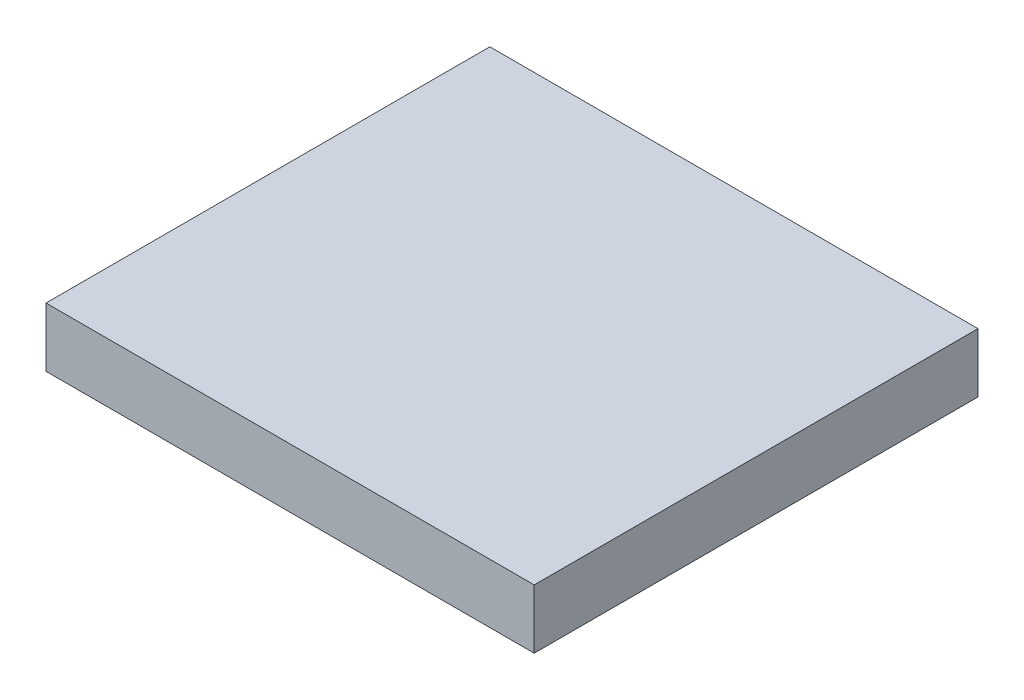
ISO-10303-21;
HEADER;
FILE_DESCRIPTION(('STEP AP214'),'2;1');
FILE_NAME('part.step','',(''),(''),'','','');
FILE_SCHEMA(('AUTOMOTIVE_DESIGN { 1 0 10303 214 1 1 1 1 }'));
ENDSEC;
DATA;
#1=APPLICATION_CONTEXT('core data for automotive mechanical design processes');
#2=APPLICATION_PROTOCOL_DEFINITION('international standard','automotive_design',2000,#1);
#3=PRODUCT_CONTEXT('',#1,'mechanical');
#4=PRODUCT('Part','Part','',(#3));
#5=PRODUCT_RELATED_PRODUCT_CATEGORY('part','',(#4));
#6=PRODUCT_DEFINITION_FORMATION('','',#4);
#7=PRODUCT_DEFINITION_CONTEXT('part definition',#1,'design');
#8=PRODUCT_DEFINITION('design','',#6,#7);
#9=PRODUCT_DEFINITION_SHAPE('','',#8);
#10=(LENGTH_UNIT() NAMED_UNIT(*) SI_UNIT(.MILLI.,.METRE.));
#11=(NAMED_UNIT(*) PLANE_ANGLE_UNIT() SI_UNIT($,.RADIAN.));
#12=(NAMED_UNIT(*) SI_UNIT($,.STERADIAN.) SOLID_ANGLE_UNIT());
#13=UNCERTAINTY_MEASURE_WITH_UNIT(LENGTH_MEASURE(1.E-05),#10,'distance_accuracy_value','');
#14=(GEOMETRIC_REPRESENTATION_CONTEXT(3) GLOBAL_UNCERTAINTY_ASSIGNED_CONTEXT((#13)) GLOBAL_UNIT_ASSIGNED_CONTEXT((#10,
#11,#12)) REPRESENTATION_CONTEXT('',''));
#15=CARTESIAN_POINT('',(0.,0.,0.));
#16=DIRECTION('',(0.,0.,1.));
#17=DIRECTION('',(1.,0.,0.));
#18=AXIS2_PLACEMENT_3D('',#15,#16,#17);
#19=CARTESIAN_POINT('',(-25.2592702702703,5.08,-10.4775));
#20=DIRECTION('',(1.,0.,0.));
#21=DIRECTION('',(0.,0.,-1.));
#22=AXIS2_PLACEMENT_3D('',#19,#20,#21);
#23=PLANE('',#22);
#24=CARTESIAN_POINT('',(-25.2592702702703,2.42272295699006,-0.317500000000001));
#25=DIRECTION('',(-1.,0.,0.));
#26=DIRECTION('',(0.,0.,1.));
#27=AXIS2_PLACEMENT_3D('',#24,#25,#26);
#28=CIRCLE('',#27,1.18745);
#29=CARTESIAN_POINT('',(-25.2592702702703,2.42272295699006,0.869949999999999));
#30=VERTEX_POINT('',#29);
#31=EDGE_CURVE('E102',#30,#30,#28,.T.);
#32=ORIENTED_EDGE('',*,*,#31,.F.);
#33=EDGE_LOOP('',(#32));
#34=FACE_BOUND('',#33,.T.);
#35=CARTESIAN_POINT('',(-25.2592702702703,2.42272295699006,22.5425));
#36=DIRECTION('',(-1.,0.,0.));
#37=DIRECTION('',(0.,0.,1.));
#38=AXIS2_PLACEMENT_3D('',#35,#36,#37);
#39=CIRCLE('',#38,1.18745);
#40=CARTESIAN_POINT('',(-25.2592702702703,2.42272295699006,23.72995));
#41=VERTEX_POINT('',#40);
#42=EDGE_CURVE('E101',#41,#41,#39,.T.);
#43=ORIENTED_EDGE('',*,*,#42,.F.);
#44=EDGE_LOOP('',(#43));
#45=FACE_BOUND('',#44,.T.);
#46=DIRECTION('',(0.,0.,1.));
#47=VECTOR('',#46,1.);
#48=CARTESIAN_POINT('',(-25.2592702702703,0.,-10.4775));
#49=LINE('',#48,#47);
#50=CARTESIAN_POINT('',(-25.2592702702703,0.,-10.4775));
#51=VERTEX_POINT('',#50);
#52=CARTESIAN_POINT('',(-25.2592702702703,0.,27.6225));
#53=VERTEX_POINT('',#52);
#54=EDGE_CURVE('E112',#51,#53,#49,.T.);
#55=ORIENTED_EDGE('',*,*,#54,.T.);
#56=DIRECTION('',(0.,-1.,0.));
#57=VECTOR('',#56,1.);
#58=CARTESIAN_POINT('',(-25.2592702702703,5.08,27.6225));
#59=LINE('',#58,#57);
#60=CARTESIAN_POINT('',(-25.2592702702703,5.08,27.6225));
#61=VERTEX_POINT('',#60);
#62=EDGE_CURVE('E11',#61,#53,#59,.T.);
#63=ORIENTED_EDGE('',*,*,#62,.F.);
#64=DIRECTION('',(0.,0.,1.));
#65=VECTOR('',#64,1.);
#66=CARTESIAN_POINT('',(-25.2592702702703,5.08,-10.4775));
#67=LINE('',#66,#65);
#68=CARTESIAN_POINT('',(-25.2592702702703,5.08,-10.4775));
#69=VERTEX_POINT('',#68);
#70=EDGE_CURVE('E113',#69,#61,#67,.T.);
#71=ORIENTED_EDGE('',*,*,#70,.F.);
#72=DIRECTION('',(0.,-1.,0.));
#73=VECTOR('',#72,1.);
#74=CARTESIAN_POINT('',(-25.2592702702703,5.08,-10.4775));
#75=LINE('',#74,#73);
#76=EDGE_CURVE('E119',#69,#51,#75,.T.);
#77=ORIENTED_EDGE('',*,*,#76,.T.);
#78=EDGE_LOOP('',(#55,#63,#71,#77));
#79=FACE_BOUND('',#78,.T.);
#80=ADVANCED_FACE('F37',(#34,#45,#79),#23,.F.);
#81=CARTESIAN_POINT('',(-25.2592702702703,5.08,27.6225));
#82=DIRECTION('',(0.,0.,-1.));
#83=DIRECTION('',(-1.,0.,0.));
#84=AXIS2_PLACEMENT_3D('',#81,#82,#83);
#85=PLANE('',#84);
#86=DIRECTION('',(1.,0.,0.));
#87=VECTOR('',#86,1.);
#88=CARTESIAN_POINT('',(-25.2592702702703,0.,27.6225));
#89=LINE('',#88,#87);
#90=CARTESIAN_POINT('',(16.6507297297297,0.,27.6225));
#91=VERTEX_POINT('',#90);
#92=EDGE_CURVE('E122',#53,#91,#89,.T.);
#93=ORIENTED_EDGE('',*,*,#92,.T.);
#94=DIRECTION('',(0.,-1.,0.));
#95=VECTOR('',#94,1.);
#96=CARTESIAN_POINT('',(16.6507297297297,5.08,27.6225));
#97=LINE('',#96,#95);
#98=CARTESIAN_POINT('',(16.6507297297297,5.08,27.6225));
#99=VERTEX_POINT('',#98);
#100=EDGE_CURVE('E45',#99,#91,#97,.T.);
#101=ORIENTED_EDGE('',*,*,#100,.F.);
#102=DIRECTION('',(1.,0.,0.));
#103=VECTOR('',#102,1.);
#104=CARTESIAN_POINT('',(-25.2592702702703,5.08,27.6225));
#105=LINE('',#104,#103);
#106=EDGE_CURVE('E84',#61,#99,#105,.T.);
#107=ORIENTED_EDGE('',*,*,#106,.F.);
#108=ORIENTED_EDGE('',*,*,#62,.T.);
#109=EDGE_LOOP('',(#93,#101,#107,#108));
#110=FACE_BOUND('',#109,.T.);
#111=ADVANCED_FACE('F145',(#110),#85,.F.);
#112=CARTESIAN_POINT('',(16.6507297297297,5.08,-10.4775));
#113=DIRECTION('',(-1.,0.,0.));
#114=DIRECTION('',(0.,0.,1.));
#115=AXIS2_PLACEMENT_3D('',#112,#113,#114);
#116=PLANE('',#115);
#117=DIRECTION('',(0.,0.,-1.));
#118=VECTOR('',#117,1.);
#119=CARTESIAN_POINT('',(16.6507297297297,0.,-10.4775));
#120=LINE('',#119,#118);
#121=CARTESIAN_POINT('',(16.6507297297297,0.,-10.4775));
#122=VERTEX_POINT('',#121);
#123=EDGE_CURVE('E71',#91,#122,#120,.T.);
#124=ORIENTED_EDGE('',*,*,#123,.T.);
#125=DIRECTION('',(0.,-1.,0.));
#126=VECTOR('',#125,1.);
#127=CARTESIAN_POINT('',(16.6507297297297,5.08,-10.4775));
#128=LINE('',#127,#126);
#129=CARTESIAN_POINT('',(16.6507297297297,5.08,-10.4775));
#130=VERTEX_POINT('',#129);
#131=EDGE_CURVE('E127',#130,#122,#128,.T.);
#132=ORIENTED_EDGE('',*,*,#131,.F.);
#133=DIRECTION('',(0.,0.,-1.));
#134=VECTOR('',#133,1.);
#135=CARTESIAN_POINT('',(16.6507297297297,5.08,-10.4775));
#136=LINE('',#135,#134);
#137=EDGE_CURVE('E116',#99,#130,#136,.T.);
#138=ORIENTED_EDGE('',*,*,#137,.F.);
#139=ORIENTED_EDGE('',*,*,#100,.T.);
#140=EDGE_LOOP('',(#124,#132,#138,#139));
#141=FACE_BOUND('',#140,.T.);
#142=ADVANCED_FACE('F129',(#141),#116,.F.);
#143=CARTESIAN_POINT('',(-25.2592702702703,5.08,-10.4775));
#144=DIRECTION('',(0.,0.,1.));
#145=DIRECTION('',(1.,0.,0.));
#146=AXIS2_PLACEMENT_3D('',#143,#144,#145);
#147=PLANE('',#146);
#148=DIRECTION('',(-1.,0.,0.));
#149=VECTOR('',#148,1.);
#150=CARTESIAN_POINT('',(-25.2592702702703,0.,-10.4775));
#151=LINE('',#150,#149);
#152=EDGE_CURVE('E77',#122,#51,#151,.T.);
#153=ORIENTED_EDGE('',*,*,#152,.T.);
#154=ORIENTED_EDGE('',*,*,#76,.F.);
#155=DIRECTION('',(-1.,0.,0.));
#156=VECTOR('',#155,1.);
#157=CARTESIAN_POINT('',(-25.2592702702703,5.08,-10.4775));
#158=LINE('',#157,#156);
#159=EDGE_CURVE('E53',#130,#69,#158,.T.);
#160=ORIENTED_EDGE('',*,*,#159,.F.);
#161=ORIENTED_EDGE('',*,*,#131,.T.);
#162=EDGE_LOOP('',(#153,#154,#160,#161));
#163=FACE_BOUND('',#162,.T.);
#164=ADVANCED_FACE('F136',(#163),#147,.F.);
#165=CARTESIAN_POINT('',(0.,5.08,0.));
#166=DIRECTION('',(0.,1.,0.));
#167=DIRECTION('',(0.,0.,1.));
#168=AXIS2_PLACEMENT_3D('',#165,#166,#167);
#169=PLANE('',#168);
#170=ORIENTED_EDGE('',*,*,#70,.T.);
#171=ORIENTED_EDGE('',*,*,#106,.T.);
#172=ORIENTED_EDGE('',*,*,#137,.T.);
#173=ORIENTED_EDGE('',*,*,#159,.T.);
#174=EDGE_LOOP('',(#170,#171,#172,#173));
#175=FACE_BOUND('',#174,.T.);
#176=ADVANCED_FACE('F138',(#175),#169,.T.);
#177=CARTESIAN_POINT('',(0.,0.,0.));
#178=DIRECTION('',(0.,1.,0.));
#179=DIRECTION('',(0.,0.,1.));
#180=AXIS2_PLACEMENT_3D('',#177,#178,#179);
#181=PLANE('',#180);
#182=ORIENTED_EDGE('',*,*,#54,.F.);
#183=ORIENTED_EDGE('',*,*,#152,.F.);
#184=ORIENTED_EDGE('',*,*,#123,.F.);
#185=ORIENTED_EDGE('',*,*,#92,.F.);
#186=EDGE_LOOP('',(#182,#183,#184,#185));
#187=FACE_BOUND('',#186,.T.);
#188=ADVANCED_FACE('F132',(#187),#181,.F.);
#189=CARTESIAN_POINT('',(-15.0992702702703,2.42272295699006,22.5425));
#190=DIRECTION('',(-1.,0.,0.));
#191=DIRECTION('',(0.,0.,1.));
#192=AXIS2_PLACEMENT_3D('',#189,#190,#191);
#193=CONICAL_SURFACE('',#192,1.18745,1.02974425867665);
#194=CARTESIAN_POINT('',(-14.385778328206,2.42272295699006,22.5425));
#195=VERTEX_POINT('',#194);
#196=VERTEX_LOOP('',#195);
#197=FACE_BOUND('',#196,.T.);
#198=CARTESIAN_POINT('',(-15.0992702702703,2.42272295699006,22.5425));
#199=DIRECTION('',(-1.,0.,0.));
#200=DIRECTION('',(0.,0.,1.));
#201=AXIS2_PLACEMENT_3D('',#198,#199,#200);
#202=CIRCLE('',#201,1.18745);
#203=CARTESIAN_POINT('',(-15.0992702702703,2.42272295699006,23.72995));
#204=VERTEX_POINT('',#203);
#205=EDGE_CURVE('E105',#204,#204,#202,.T.);
#206=ORIENTED_EDGE('',*,*,#205,.T.);
#207=EDGE_LOOP('',(#206));
#208=FACE_BOUND('',#207,.T.);
#209=ADVANCED_FACE('F158',(#197,#208),#193,.F.);
#210=CARTESIAN_POINT('',(-25.2592702702703,2.42272295699006,22.5425));
#211=DIRECTION('',(-1.,0.,0.));
#212=DIRECTION('',(0.,0.,1.));
#213=AXIS2_PLACEMENT_3D('',#210,#211,#212);
#214=CYLINDRICAL_SURFACE('',#213,1.18745);
#215=ORIENTED_EDGE('',*,*,#205,.F.);
#216=EDGE_LOOP('',(#215));
#217=FACE_BOUND('',#216,.T.);
#218=ORIENTED_EDGE('',*,*,#42,.T.);
#219=EDGE_LOOP('',(#218));
#220=FACE_BOUND('',#219,.T.);
#221=ADVANCED_FACE('F95',(#217,#220),#214,.F.);
#222=CARTESIAN_POINT('',(-15.0992702702703,2.42272295699006,-0.317500000000003));
#223=DIRECTION('',(-1.,0.,0.));
#224=DIRECTION('',(0.,0.,1.));
#225=AXIS2_PLACEMENT_3D('',#222,#223,#224);
#226=CONICAL_SURFACE('',#225,1.18745,1.02974425867665);
#227=CARTESIAN_POINT('',(-14.385778328206,2.42272295699006,-0.317500000000003));
#228=VERTEX_POINT('',#227);
#229=VERTEX_LOOP('',#228);
#230=FACE_BOUND('',#229,.T.);
#231=CARTESIAN_POINT('',(-15.0992702702703,2.42272295699006,-0.317500000000003));
#232=DIRECTION('',(-1.,0.,0.));
#233=DIRECTION('',(0.,0.,1.));
#234=AXIS2_PLACEMENT_3D('',#231,#232,#233);
#235=CIRCLE('',#234,1.18745);
#236=CARTESIAN_POINT('',(-15.0992702702703,2.42272295699006,0.869949999999995));
#237=VERTEX_POINT('',#236);
#238=EDGE_CURVE('E99',#237,#237,#235,.T.);
#239=ORIENTED_EDGE('',*,*,#238,.T.);
#240=EDGE_LOOP('',(#239));
#241=FACE_BOUND('',#240,.T.);
#242=ADVANCED_FACE('F91',(#230,#241),#226,.F.);
#243=CARTESIAN_POINT('',(-25.2592702702703,2.42272295699006,-0.317500000000001));
#244=DIRECTION('',(-1.,0.,0.));
#245=DIRECTION('',(0.,0.,1.));
#246=AXIS2_PLACEMENT_3D('',#243,#244,#245);
#247=CYLINDRICAL_SURFACE('',#246,1.18745);
#248=ORIENTED_EDGE('',*,*,#238,.F.);
#249=EDGE_LOOP('',(#248));
#250=FACE_BOUND('',#249,.T.);
#251=ORIENTED_EDGE('',*,*,#31,.T.);
#252=EDGE_LOOP('',(#251));
#253=FACE_BOUND('',#252,.T.);
#254=ADVANCED_FACE('F94',(#250,#253),#247,.F.);
#255=CLOSED_SHELL('',(#80,#111,#142,#164,#176,#188,#209,#221,#242,#254));
#256=MANIFOLD_SOLID_BREP('B2',#255);
#257=ADVANCED_BREP_SHAPE_REPRESENTATION('',(#18,#256),#14);
#258=SHAPE_DEFINITION_REPRESENTATION(#9,#257);
ENDSEC;
END-ISO-10303-21;
